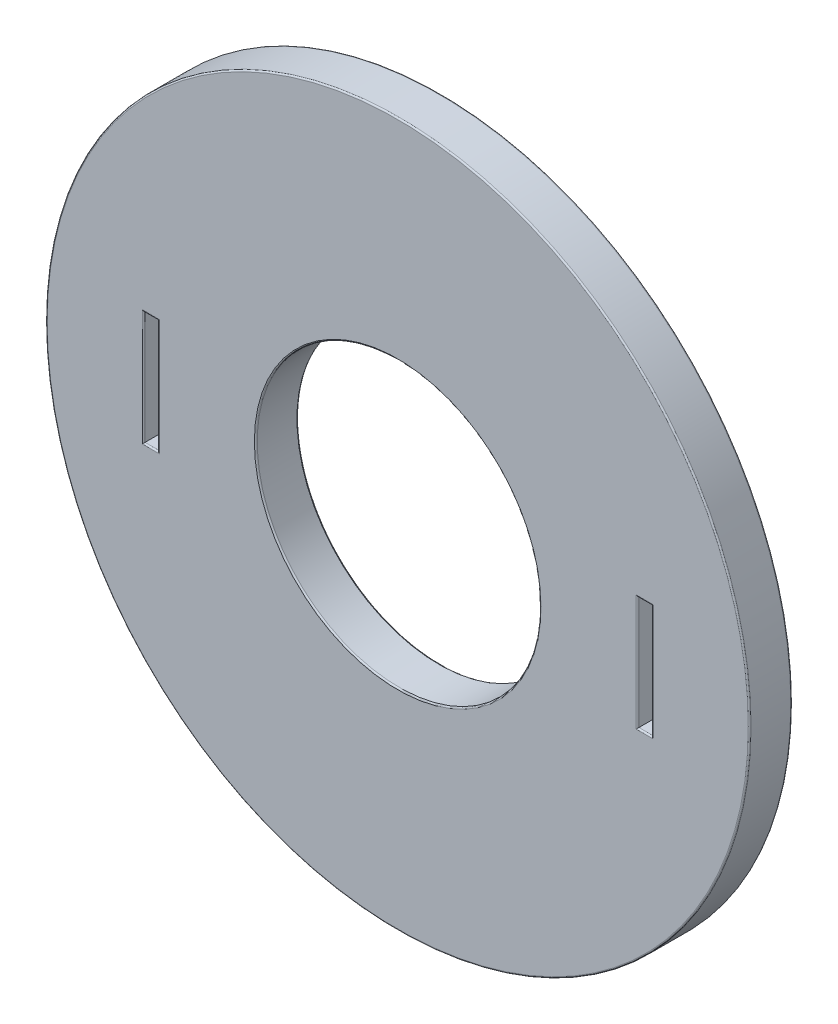
ISO-10303-21;
HEADER;
FILE_DESCRIPTION(('STEP AP214'),'2;1');
FILE_NAME('part.step','',(''),(''),'','','');
FILE_SCHEMA(('AUTOMOTIVE_DESIGN { 1 0 10303 214 1 1 1 1 }'));
ENDSEC;
DATA;
#1=APPLICATION_CONTEXT('core data for automotive mechanical design processes');
#2=APPLICATION_PROTOCOL_DEFINITION('international standard','automotive_design',2000,#1);
#3=PRODUCT_CONTEXT('',#1,'mechanical');
#4=PRODUCT('Part','Part','',(#3));
#5=PRODUCT_RELATED_PRODUCT_CATEGORY('part','',(#4));
#6=PRODUCT_DEFINITION_FORMATION('','',#4);
#7=PRODUCT_DEFINITION_CONTEXT('part definition',#1,'design');
#8=PRODUCT_DEFINITION('design','',#6,#7);
#9=PRODUCT_DEFINITION_SHAPE('','',#8);
#10=(LENGTH_UNIT() NAMED_UNIT(*) SI_UNIT(.MILLI.,.METRE.));
#11=(NAMED_UNIT(*) PLANE_ANGLE_UNIT() SI_UNIT($,.RADIAN.));
#12=(NAMED_UNIT(*) SI_UNIT($,.STERADIAN.) SOLID_ANGLE_UNIT());
#13=UNCERTAINTY_MEASURE_WITH_UNIT(LENGTH_MEASURE(1.E-05),#10,'distance_accuracy_value','');
#14=(GEOMETRIC_REPRESENTATION_CONTEXT(3) GLOBAL_UNCERTAINTY_ASSIGNED_CONTEXT((#13)) GLOBAL_UNIT_ASSIGNED_CONTEXT((#10,
#11,#12)) REPRESENTATION_CONTEXT('',''));
#15=CARTESIAN_POINT('',(0.,0.,0.));
#16=DIRECTION('',(0.,0.,1.));
#17=DIRECTION('',(1.,0.,0.));
#18=AXIS2_PLACEMENT_3D('',#15,#16,#17);
#19=CARTESIAN_POINT('',(0.,0.,1.5));
#20=DIRECTION('',(0.,0.,-1.));
#21=DIRECTION('',(-1.,0.,0.));
#22=AXIS2_PLACEMENT_3D('',#19,#20,#21);
#23=CYLINDRICAL_SURFACE('',#22,12.4);
#24=CARTESIAN_POINT('',(0.,0.,0.0499999999999999));
#25=DIRECTION('',(0.,0.,1.));
#26=DIRECTION('',(1.,0.,0.));
#27=AXIS2_PLACEMENT_3D('',#24,#25,#26);
#28=CIRCLE('',#27,12.4);
#29=CARTESIAN_POINT('',(12.4,0.,0.0499999999999999));
#30=VERTEX_POINT('',#29);
#31=EDGE_CURVE('E176',#30,#30,#28,.T.);
#32=ORIENTED_EDGE('',*,*,#31,.T.);
#33=EDGE_LOOP('',(#32));
#34=FACE_BOUND('',#33,.T.);
#35=CARTESIAN_POINT('',(0.,0.,1.45));
#36=DIRECTION('',(0.,0.,1.));
#37=DIRECTION('',(1.,0.,0.));
#38=AXIS2_PLACEMENT_3D('',#35,#36,#37);
#39=CIRCLE('',#38,12.4);
#40=CARTESIAN_POINT('',(12.4,0.,1.45));
#41=VERTEX_POINT('',#40);
#42=EDGE_CURVE('E425',#41,#41,#39,.F.);
#43=ORIENTED_EDGE('',*,*,#42,.T.);
#44=EDGE_LOOP('',(#43));
#45=FACE_BOUND('',#44,.T.);
#46=ADVANCED_FACE('F35',(#34,#45),#23,.T.);
#47=CARTESIAN_POINT('',(0.,0.,1.5));
#48=DIRECTION('',(0.,0.,1.));
#49=DIRECTION('',(1.,0.,0.));
#50=AXIS2_PLACEMENT_3D('',#47,#48,#49);
#51=PLANE('',#50);
#52=CARTESIAN_POINT('',(0.,0.,1.5));
#53=DIRECTION('',(0.,0.,1.));
#54=DIRECTION('',(1.,0.,0.));
#55=AXIS2_PLACEMENT_3D('',#52,#53,#54);
#56=CIRCLE('',#55,12.35);
#57=CARTESIAN_POINT('',(12.35,0.,1.5));
#58=VERTEX_POINT('',#57);
#59=EDGE_CURVE('E216',#58,#58,#56,.T.);
#60=ORIENTED_EDGE('',*,*,#59,.T.);
#61=EDGE_LOOP('',(#60));
#62=FACE_BOUND('',#61,.T.);
#63=CARTESIAN_POINT('',(0.,0.,1.5));
#64=DIRECTION('',(0.,0.,1.));
#65=DIRECTION('',(1.,0.,0.));
#66=AXIS2_PLACEMENT_3D('',#63,#64,#65);
#67=CIRCLE('',#66,5.05);
#68=CARTESIAN_POINT('',(5.05,0.,1.5));
#69=VERTEX_POINT('',#68);
#70=EDGE_CURVE('E213',#69,#69,#67,.F.);
#71=ORIENTED_EDGE('',*,*,#70,.T.);
#72=EDGE_LOOP('',(#71));
#73=FACE_BOUND('',#72,.T.);
#74=DIRECTION('',(0.,1.,0.));
#75=VECTOR('',#74,1.);
#76=CARTESIAN_POINT('',(-8.4,-2.,1.5));
#77=LINE('',#76,#75);
#78=CARTESIAN_POINT('',(-8.4,2.05,1.5));
#79=VERTEX_POINT('',#78);
#80=CARTESIAN_POINT('',(-8.4,-2.05,1.5));
#81=VERTEX_POINT('',#80);
#82=EDGE_CURVE('E208',#79,#81,#77,.F.);
#83=ORIENTED_EDGE('',*,*,#82,.T.);
#84=DIRECTION('',(1.,0.,0.));
#85=VECTOR('',#84,1.);
#86=CARTESIAN_POINT('',(-8.95,-2.05,1.5));
#87=LINE('',#86,#85);
#88=CARTESIAN_POINT('',(-9.,-2.05,1.5));
#89=VERTEX_POINT('',#88);
#90=EDGE_CURVE('E210',#81,#89,#87,.F.);
#91=ORIENTED_EDGE('',*,*,#90,.T.);
#92=DIRECTION('',(0.,-1.,0.));
#93=VECTOR('',#92,1.);
#94=CARTESIAN_POINT('',(-9.,2.,1.5));
#95=LINE('',#94,#93);
#96=CARTESIAN_POINT('',(-9.,2.05,1.5));
#97=VERTEX_POINT('',#96);
#98=EDGE_CURVE('E204',#89,#97,#95,.F.);
#99=ORIENTED_EDGE('',*,*,#98,.T.);
#100=DIRECTION('',(-1.,0.,0.));
#101=VECTOR('',#100,1.);
#102=CARTESIAN_POINT('',(-8.45,2.05,1.5));
#103=LINE('',#102,#101);
#104=EDGE_CURVE('E206',#97,#79,#103,.F.);
#105=ORIENTED_EDGE('',*,*,#104,.T.);
#106=EDGE_LOOP('',(#83,#91,#99,#105));
#107=FACE_BOUND('',#106,.T.);
#108=DIRECTION('',(0.,1.,0.));
#109=VECTOR('',#108,1.);
#110=CARTESIAN_POINT('',(9.,-2.,1.5));
#111=LINE('',#110,#109);
#112=CARTESIAN_POINT('',(9.,2.05,1.5));
#113=VERTEX_POINT('',#112);
#114=CARTESIAN_POINT('',(9.,-2.05,1.5));
#115=VERTEX_POINT('',#114);
#116=EDGE_CURVE('E199',#113,#115,#111,.F.);
#117=ORIENTED_EDGE('',*,*,#116,.T.);
#118=DIRECTION('',(1.,0.,0.));
#119=VECTOR('',#118,1.);
#120=CARTESIAN_POINT('',(8.45,-2.05,1.5));
#121=LINE('',#120,#119);
#122=CARTESIAN_POINT('',(8.4,-2.05,1.5));
#123=VERTEX_POINT('',#122);
#124=EDGE_CURVE('E201',#115,#123,#121,.F.);
#125=ORIENTED_EDGE('',*,*,#124,.T.);
#126=DIRECTION('',(0.,-1.,0.));
#127=VECTOR('',#126,1.);
#128=CARTESIAN_POINT('',(8.4,2.,1.5));
#129=LINE('',#128,#127);
#130=CARTESIAN_POINT('',(8.4,2.05,1.5));
#131=VERTEX_POINT('',#130);
#132=EDGE_CURVE('E195',#123,#131,#129,.F.);
#133=ORIENTED_EDGE('',*,*,#132,.T.);
#134=DIRECTION('',(-1.,0.,0.));
#135=VECTOR('',#134,1.);
#136=CARTESIAN_POINT('',(8.95,2.05,1.5));
#137=LINE('',#136,#135);
#138=EDGE_CURVE('E197',#131,#113,#137,.F.);
#139=ORIENTED_EDGE('',*,*,#138,.T.);
#140=EDGE_LOOP('',(#117,#125,#133,#139));
#141=FACE_BOUND('',#140,.T.);
#142=ADVANCED_FACE('F317',(#62,#73,#107,#141),#51,.T.);
#143=CARTESIAN_POINT('',(0.,0.,0.));
#144=DIRECTION('',(0.,0.,1.));
#145=DIRECTION('',(1.,0.,0.));
#146=AXIS2_PLACEMENT_3D('',#143,#144,#145);
#147=PLANE('',#146);
#148=CARTESIAN_POINT('',(0.,0.,0.));
#149=DIRECTION('',(0.,0.,1.));
#150=DIRECTION('',(1.,0.,0.));
#151=AXIS2_PLACEMENT_3D('',#148,#149,#150);
#152=CIRCLE('',#151,12.35);
#153=CARTESIAN_POINT('',(12.35,0.,0.));
#154=VERTEX_POINT('',#153);
#155=EDGE_CURVE('E192',#154,#154,#152,.F.);
#156=ORIENTED_EDGE('',*,*,#155,.T.);
#157=EDGE_LOOP('',(#156));
#158=FACE_BOUND('',#157,.T.);
#159=DIRECTION('',(0.,-1.,0.));
#160=VECTOR('',#159,1.);
#161=CARTESIAN_POINT('',(-9.,0.,0.));
#162=LINE('',#161,#160);
#163=CARTESIAN_POINT('',(-9.,2.05,0.));
#164=VERTEX_POINT('',#163);
#165=CARTESIAN_POINT('',(-9.,-2.05,0.));
#166=VERTEX_POINT('',#165);
#167=EDGE_CURVE('E187',#164,#166,#162,.T.);
#168=ORIENTED_EDGE('',*,*,#167,.T.);
#169=DIRECTION('',(1.,0.,0.));
#170=VECTOR('',#169,1.);
#171=CARTESIAN_POINT('',(0.,-2.05,0.));
#172=LINE('',#171,#170);
#173=CARTESIAN_POINT('',(-8.4,-2.05,0.));
#174=VERTEX_POINT('',#173);
#175=EDGE_CURVE('E189',#166,#174,#172,.T.);
#176=ORIENTED_EDGE('',*,*,#175,.T.);
#177=DIRECTION('',(0.,1.,0.));
#178=VECTOR('',#177,1.);
#179=CARTESIAN_POINT('',(-8.4,0.,0.));
#180=LINE('',#179,#178);
#181=CARTESIAN_POINT('',(-8.4,2.05,0.));
#182=VERTEX_POINT('',#181);
#183=EDGE_CURVE('E185',#174,#182,#180,.T.);
#184=ORIENTED_EDGE('',*,*,#183,.T.);
#185=DIRECTION('',(-1.,0.,0.));
#186=VECTOR('',#185,1.);
#187=CARTESIAN_POINT('',(0.,2.04999999999999,0.));
#188=LINE('',#187,#186);
#189=EDGE_CURVE('E183',#182,#164,#188,.T.);
#190=ORIENTED_EDGE('',*,*,#189,.T.);
#191=EDGE_LOOP('',(#168,#176,#184,#190));
#192=FACE_BOUND('',#191,.T.);
#193=DIRECTION('',(0.,-1.,0.));
#194=VECTOR('',#193,1.);
#195=CARTESIAN_POINT('',(8.4,0.,0.));
#196=LINE('',#195,#194);
#197=CARTESIAN_POINT('',(8.4,2.05,0.));
#198=VERTEX_POINT('',#197);
#199=CARTESIAN_POINT('',(8.4,-2.05,0.));
#200=VERTEX_POINT('',#199);
#201=EDGE_CURVE('E155',#198,#200,#196,.T.);
#202=ORIENTED_EDGE('',*,*,#201,.T.);
#203=DIRECTION('',(1.,0.,0.));
#204=VECTOR('',#203,1.);
#205=CARTESIAN_POINT('',(0.,-2.05,0.));
#206=LINE('',#205,#204);
#207=CARTESIAN_POINT('',(9.,-2.05,0.));
#208=VERTEX_POINT('',#207);
#209=EDGE_CURVE('E181',#200,#208,#206,.T.);
#210=ORIENTED_EDGE('',*,*,#209,.T.);
#211=DIRECTION('',(0.,1.,0.));
#212=VECTOR('',#211,1.);
#213=CARTESIAN_POINT('',(9.,0.,0.));
#214=LINE('',#213,#212);
#215=CARTESIAN_POINT('',(9.,2.05,0.));
#216=VERTEX_POINT('',#215);
#217=EDGE_CURVE('E158',#208,#216,#214,.T.);
#218=ORIENTED_EDGE('',*,*,#217,.T.);
#219=DIRECTION('',(-1.,0.,0.));
#220=VECTOR('',#219,1.);
#221=CARTESIAN_POINT('',(0.,2.05000000000001,0.));
#222=LINE('',#221,#220);
#223=EDGE_CURVE('E149',#216,#198,#222,.T.);
#224=ORIENTED_EDGE('',*,*,#223,.T.);
#225=EDGE_LOOP('',(#202,#210,#218,#224));
#226=FACE_BOUND('',#225,.T.);
#227=CARTESIAN_POINT('',(0.,0.,0.));
#228=DIRECTION('',(0.,0.,1.));
#229=DIRECTION('',(1.,0.,0.));
#230=AXIS2_PLACEMENT_3D('',#227,#228,#229);
#231=CIRCLE('',#230,5.05);
#232=CARTESIAN_POINT('',(5.05,0.,0.));
#233=VERTEX_POINT('',#232);
#234=EDGE_CURVE('E173',#233,#233,#231,.T.);
#235=ORIENTED_EDGE('',*,*,#234,.T.);
#236=EDGE_LOOP('',(#235));
#237=FACE_BOUND('',#236,.T.);
#238=ADVANCED_FACE('F151',(#158,#192,#226,#237),#147,.F.);
#239=CARTESIAN_POINT('',(0.,0.,0.));
#240=DIRECTION('',(0.,0.,1.));
#241=DIRECTION('',(1.,0.,0.));
#242=AXIS2_PLACEMENT_3D('',#239,#240,#241);
#243=CYLINDRICAL_SURFACE('',#242,5.);
#244=CARTESIAN_POINT('',(0.,0.,1.45));
#245=DIRECTION('',(0.,0.,1.));
#246=DIRECTION('',(1.,0.,0.));
#247=AXIS2_PLACEMENT_3D('',#244,#245,#246);
#248=CIRCLE('',#247,5.);
#249=CARTESIAN_POINT('',(5.,0.,1.45));
#250=VERTEX_POINT('',#249);
#251=EDGE_CURVE('E222',#250,#250,#248,.T.);
#252=ORIENTED_EDGE('',*,*,#251,.T.);
#253=EDGE_LOOP('',(#252));
#254=FACE_BOUND('',#253,.T.);
#255=CARTESIAN_POINT('',(0.,0.,0.05));
#256=DIRECTION('',(0.,0.,1.));
#257=DIRECTION('',(1.,0.,0.));
#258=AXIS2_PLACEMENT_3D('',#255,#256,#257);
#259=CIRCLE('',#258,5.);
#260=CARTESIAN_POINT('',(5.,0.,0.05));
#261=VERTEX_POINT('',#260);
#262=EDGE_CURVE('E219',#261,#261,#259,.F.);
#263=ORIENTED_EDGE('',*,*,#262,.T.);
#264=EDGE_LOOP('',(#263));
#265=FACE_BOUND('',#264,.T.);
#266=ADVANCED_FACE('F468',(#254,#265),#243,.F.);
#267=CARTESIAN_POINT('',(-8.95,2.,0.));
#268=DIRECTION('',(-1.,0.,0.));
#269=DIRECTION('',(0.,0.,1.));
#270=AXIS2_PLACEMENT_3D('',#267,#268,#269);
#271=PLANE('',#270);
#272=DIRECTION('',(0.,0.,1.));
#273=VECTOR('',#272,1.);
#274=CARTESIAN_POINT('',(-8.95,2.,0.));
#275=LINE('',#274,#273);
#276=CARTESIAN_POINT('',(-8.95,2.,0.05));
#277=VERTEX_POINT('',#276);
#278=CARTESIAN_POINT('',(-8.95,2.,1.45));
#279=VERTEX_POINT('',#278);
#280=EDGE_CURVE('E420',#277,#279,#275,.T.);
#281=ORIENTED_EDGE('',*,*,#280,.T.);
#282=DIRECTION('',(0.,-1.,0.));
#283=VECTOR('',#282,1.);
#284=CARTESIAN_POINT('',(-8.95,-2.,1.45));
#285=LINE('',#284,#283);
#286=CARTESIAN_POINT('',(-8.95,-2.,1.45));
#287=VERTEX_POINT('',#286);
#288=EDGE_CURVE('E241',#279,#287,#285,.T.);
#289=ORIENTED_EDGE('',*,*,#288,.T.);
#290=DIRECTION('',(0.,0.,1.));
#291=VECTOR('',#290,1.);
#292=CARTESIAN_POINT('',(-8.95,-2.,0.));
#293=LINE('',#292,#291);
#294=CARTESIAN_POINT('',(-8.95,-2.,0.05));
#295=VERTEX_POINT('',#294);
#296=EDGE_CURVE('E410',#295,#287,#293,.T.);
#297=ORIENTED_EDGE('',*,*,#296,.F.);
#298=DIRECTION('',(0.,-1.,0.));
#299=VECTOR('',#298,1.);
#300=CARTESIAN_POINT('',(-8.95,2.,0.05));
#301=LINE('',#300,#299);
#302=EDGE_CURVE('E239',#295,#277,#301,.F.);
#303=ORIENTED_EDGE('',*,*,#302,.T.);
#304=EDGE_LOOP('',(#281,#289,#297,#303));
#305=FACE_BOUND('',#304,.T.);
#306=ADVANCED_FACE('F419',(#305),#271,.F.);
#307=CARTESIAN_POINT('',(-8.95,2.,0.));
#308=DIRECTION('',(0.,1.,0.));
#309=DIRECTION('',(-1.,0.,0.));
#310=AXIS2_PLACEMENT_3D('',#307,#308,#309);
#311=PLANE('',#310);
#312=DIRECTION('',(0.,0.,1.));
#313=VECTOR('',#312,1.);
#314=CARTESIAN_POINT('',(-8.45,2.,0.));
#315=LINE('',#314,#313);
#316=CARTESIAN_POINT('',(-8.45,2.,0.05));
#317=VERTEX_POINT('',#316);
#318=CARTESIAN_POINT('',(-8.45,2.,1.45));
#319=VERTEX_POINT('',#318);
#320=EDGE_CURVE('E403',#317,#319,#315,.T.);
#321=ORIENTED_EDGE('',*,*,#320,.T.);
#322=DIRECTION('',(-1.,0.,0.));
#323=VECTOR('',#322,1.);
#324=CARTESIAN_POINT('',(-8.95,2.,1.45));
#325=LINE('',#324,#323);
#326=EDGE_CURVE('E237',#319,#279,#325,.T.);
#327=ORIENTED_EDGE('',*,*,#326,.T.);
#328=ORIENTED_EDGE('',*,*,#280,.F.);
#329=DIRECTION('',(-1.,0.,0.));
#330=VECTOR('',#329,1.);
#331=CARTESIAN_POINT('',(-8.95,2.,0.05));
#332=LINE('',#331,#330);
#333=EDGE_CURVE('E235',#277,#317,#332,.F.);
#334=ORIENTED_EDGE('',*,*,#333,.T.);
#335=EDGE_LOOP('',(#321,#327,#328,#334));
#336=FACE_BOUND('',#335,.T.);
#337=ADVANCED_FACE('F423',(#336),#311,.F.);
#338=CARTESIAN_POINT('',(-8.45,2.,0.));
#339=DIRECTION('',(1.,0.,0.));
#340=DIRECTION('',(0.,0.,-1.));
#341=AXIS2_PLACEMENT_3D('',#338,#339,#340);
#342=PLANE('',#341);
#343=DIRECTION('',(0.,0.,1.));
#344=VECTOR('',#343,1.);
#345=CARTESIAN_POINT('',(-8.45,-2.,0.));
#346=LINE('',#345,#344);
#347=CARTESIAN_POINT('',(-8.45,-2.,0.05));
#348=VERTEX_POINT('',#347);
#349=CARTESIAN_POINT('',(-8.45,-2.,1.45));
#350=VERTEX_POINT('',#349);
#351=EDGE_CURVE('E401',#348,#350,#346,.T.);
#352=ORIENTED_EDGE('',*,*,#351,.T.);
#353=DIRECTION('',(0.,1.,0.));
#354=VECTOR('',#353,1.);
#355=CARTESIAN_POINT('',(-8.45,2.,1.45));
#356=LINE('',#355,#354);
#357=EDGE_CURVE('E233',#350,#319,#356,.T.);
#358=ORIENTED_EDGE('',*,*,#357,.T.);
#359=ORIENTED_EDGE('',*,*,#320,.F.);
#360=DIRECTION('',(0.,1.,0.));
#361=VECTOR('',#360,1.);
#362=CARTESIAN_POINT('',(-8.45,2.,0.05));
#363=LINE('',#362,#361);
#364=EDGE_CURVE('E231',#317,#348,#363,.F.);
#365=ORIENTED_EDGE('',*,*,#364,.T.);
#366=EDGE_LOOP('',(#352,#358,#359,#365));
#367=FACE_BOUND('',#366,.T.);
#368=ADVANCED_FACE('F400',(#367),#342,.F.);
#369=CARTESIAN_POINT('',(-8.95,-2.,0.));
#370=DIRECTION('',(0.,-1.,0.));
#371=DIRECTION('',(0.,0.,-1.));
#372=AXIS2_PLACEMENT_3D('',#369,#370,#371);
#373=PLANE('',#372);
#374=ORIENTED_EDGE('',*,*,#296,.T.);
#375=DIRECTION('',(1.,0.,0.));
#376=VECTOR('',#375,1.);
#377=CARTESIAN_POINT('',(-8.45,-2.,1.45));
#378=LINE('',#377,#376);
#379=EDGE_CURVE('E228',#287,#350,#378,.T.);
#380=ORIENTED_EDGE('',*,*,#379,.T.);
#381=ORIENTED_EDGE('',*,*,#351,.F.);
#382=DIRECTION('',(1.,0.,0.));
#383=VECTOR('',#382,1.);
#384=CARTESIAN_POINT('',(-8.95,-2.,0.05));
#385=LINE('',#384,#383);
#386=EDGE_CURVE('E225',#348,#295,#385,.F.);
#387=ORIENTED_EDGE('',*,*,#386,.T.);
#388=EDGE_LOOP('',(#374,#380,#381,#387));
#389=FACE_BOUND('',#388,.T.);
#390=ADVANCED_FACE('F407',(#389),#373,.F.);
#391=CARTESIAN_POINT('',(8.45,2.,0.));
#392=DIRECTION('',(-1.,0.,0.));
#393=DIRECTION('',(0.,0.,1.));
#394=AXIS2_PLACEMENT_3D('',#391,#392,#393);
#395=PLANE('',#394);
#396=DIRECTION('',(0.,0.,1.));
#397=VECTOR('',#396,1.);
#398=CARTESIAN_POINT('',(8.45,2.,0.));
#399=LINE('',#398,#397);
#400=CARTESIAN_POINT('',(8.45,2.,0.05));
#401=VERTEX_POINT('',#400);
#402=CARTESIAN_POINT('',(8.45,2.,1.45));
#403=VERTEX_POINT('',#402);
#404=EDGE_CURVE('E432',#401,#403,#399,.T.);
#405=ORIENTED_EDGE('',*,*,#404,.T.);
#406=DIRECTION('',(0.,-1.,0.));
#407=VECTOR('',#406,1.);
#408=CARTESIAN_POINT('',(8.45,-2.,1.45));
#409=LINE('',#408,#407);
#410=CARTESIAN_POINT('',(8.45,-2.,1.45));
#411=VERTEX_POINT('',#410);
#412=EDGE_CURVE('E11',#403,#411,#409,.T.);
#413=ORIENTED_EDGE('',*,*,#412,.T.);
#414=DIRECTION('',(0.,0.,1.));
#415=VECTOR('',#414,1.);
#416=CARTESIAN_POINT('',(8.45,-2.,0.));
#417=LINE('',#416,#415);
#418=CARTESIAN_POINT('',(8.45,-2.,0.05));
#419=VERTEX_POINT('',#418);
#420=EDGE_CURVE('E267',#419,#411,#417,.T.);
#421=ORIENTED_EDGE('',*,*,#420,.F.);
#422=DIRECTION('',(0.,-1.,0.));
#423=VECTOR('',#422,1.);
#424=CARTESIAN_POINT('',(8.45,2.,0.05));
#425=LINE('',#424,#423);
#426=EDGE_CURVE('E44',#419,#401,#425,.F.);
#427=ORIENTED_EDGE('',*,*,#426,.T.);
#428=EDGE_LOOP('',(#405,#413,#421,#427));
#429=FACE_BOUND('',#428,.T.);
#430=ADVANCED_FACE('F450',(#429),#395,.F.);
#431=CARTESIAN_POINT('',(8.45,2.,0.));
#432=DIRECTION('',(0.,1.,0.));
#433=DIRECTION('',(-1.,0.,0.));
#434=AXIS2_PLACEMENT_3D('',#431,#432,#433);
#435=PLANE('',#434);
#436=DIRECTION('',(0.,0.,1.));
#437=VECTOR('',#436,1.);
#438=CARTESIAN_POINT('',(8.95,2.,0.));
#439=LINE('',#438,#437);
#440=CARTESIAN_POINT('',(8.95,2.,0.05));
#441=VERTEX_POINT('',#440);
#442=CARTESIAN_POINT('',(8.95,2.,1.45));
#443=VERTEX_POINT('',#442);
#444=EDGE_CURVE('E298',#441,#443,#439,.T.);
#445=ORIENTED_EDGE('',*,*,#444,.T.);
#446=DIRECTION('',(-1.,0.,0.));
#447=VECTOR('',#446,1.);
#448=CARTESIAN_POINT('',(8.45,2.,1.45));
#449=LINE('',#448,#447);
#450=EDGE_CURVE('E52',#443,#403,#449,.T.);
#451=ORIENTED_EDGE('',*,*,#450,.T.);
#452=ORIENTED_EDGE('',*,*,#404,.F.);
#453=DIRECTION('',(-1.,0.,0.));
#454=VECTOR('',#453,1.);
#455=CARTESIAN_POINT('',(8.45,2.,0.05));
#456=LINE('',#455,#454);
#457=EDGE_CURVE('E166',#401,#441,#456,.F.);
#458=ORIENTED_EDGE('',*,*,#457,.T.);
#459=EDGE_LOOP('',(#445,#451,#452,#458));
#460=FACE_BOUND('',#459,.T.);
#461=ADVANCED_FACE('F439',(#460),#435,.F.);
#462=CARTESIAN_POINT('',(8.95,2.,0.));
#463=DIRECTION('',(1.,0.,0.));
#464=DIRECTION('',(0.,0.,-1.));
#465=AXIS2_PLACEMENT_3D('',#462,#463,#464);
#466=PLANE('',#465);
#467=DIRECTION('',(0.,0.,1.));
#468=VECTOR('',#467,1.);
#469=CARTESIAN_POINT('',(8.95,-2.,0.));
#470=LINE('',#469,#468);
#471=CARTESIAN_POINT('',(8.95,-2.,0.05));
#472=VERTEX_POINT('',#471);
#473=CARTESIAN_POINT('',(8.95,-2.,1.45));
#474=VERTEX_POINT('',#473);
#475=EDGE_CURVE('E297',#472,#474,#470,.T.);
#476=ORIENTED_EDGE('',*,*,#475,.T.);
#477=DIRECTION('',(0.,1.,0.));
#478=VECTOR('',#477,1.);
#479=CARTESIAN_POINT('',(8.95,2.,1.45));
#480=LINE('',#479,#478);
#481=EDGE_CURVE('E251',#474,#443,#480,.T.);
#482=ORIENTED_EDGE('',*,*,#481,.T.);
#483=ORIENTED_EDGE('',*,*,#444,.F.);
#484=DIRECTION('',(0.,1.,0.));
#485=VECTOR('',#484,1.);
#486=CARTESIAN_POINT('',(8.95,2.,0.05));
#487=LINE('',#486,#485);
#488=EDGE_CURVE('E249',#441,#472,#487,.F.);
#489=ORIENTED_EDGE('',*,*,#488,.T.);
#490=EDGE_LOOP('',(#476,#482,#483,#489));
#491=FACE_BOUND('',#490,.T.);
#492=ADVANCED_FACE('F296',(#491),#466,.F.);
#493=CARTESIAN_POINT('',(8.45,-2.,0.));
#494=DIRECTION('',(0.,-1.,0.));
#495=DIRECTION('',(0.,0.,-1.));
#496=AXIS2_PLACEMENT_3D('',#493,#494,#495);
#497=PLANE('',#496);
#498=ORIENTED_EDGE('',*,*,#420,.T.);
#499=DIRECTION('',(1.,0.,0.));
#500=VECTOR('',#499,1.);
#501=CARTESIAN_POINT('',(8.95,-2.,1.45));
#502=LINE('',#501,#500);
#503=EDGE_CURVE('E246',#411,#474,#502,.T.);
#504=ORIENTED_EDGE('',*,*,#503,.T.);
#505=ORIENTED_EDGE('',*,*,#475,.F.);
#506=DIRECTION('',(1.,0.,0.));
#507=VECTOR('',#506,1.);
#508=CARTESIAN_POINT('',(8.45,-2.,0.05));
#509=LINE('',#508,#507);
#510=EDGE_CURVE('E243',#472,#419,#509,.F.);
#511=ORIENTED_EDGE('',*,*,#510,.T.);
#512=EDGE_LOOP('',(#498,#504,#505,#511));
#513=FACE_BOUND('',#512,.T.);
#514=ADVANCED_FACE('F302',(#513),#497,.F.);
#515=CARTESIAN_POINT('',(0.,0.,0.0499999999999999));
#516=DIRECTION('',(0.,0.,1.));
#517=DIRECTION('',(1.,0.,0.));
#518=AXIS2_PLACEMENT_3D('',#515,#516,#517);
#519=TOROIDAL_SURFACE('',#518,12.35,0.05);
#520=ORIENTED_EDGE('',*,*,#155,.F.);
#521=EDGE_LOOP('',(#520));
#522=FACE_BOUND('',#521,.T.);
#523=ORIENTED_EDGE('',*,*,#31,.F.);
#524=EDGE_LOOP('',(#523));
#525=FACE_BOUND('',#524,.T.);
#526=ADVANCED_FACE('F329',(#522,#525),#519,.T.);
#527=CARTESIAN_POINT('',(0.,0.,1.45));
#528=DIRECTION('',(0.,0.,1.));
#529=DIRECTION('',(1.,0.,0.));
#530=AXIS2_PLACEMENT_3D('',#527,#528,#529);
#531=TOROIDAL_SURFACE('',#530,12.35,0.05);
#532=ORIENTED_EDGE('',*,*,#42,.F.);
#533=EDGE_LOOP('',(#532));
#534=FACE_BOUND('',#533,.T.);
#535=ORIENTED_EDGE('',*,*,#59,.F.);
#536=EDGE_LOOP('',(#535));
#537=FACE_BOUND('',#536,.T.);
#538=ADVANCED_FACE('F332',(#534,#537),#531,.T.);
#539=CARTESIAN_POINT('',(0.,0.,1.45));
#540=DIRECTION('',(0.,0.,1.));
#541=DIRECTION('',(1.,0.,0.));
#542=AXIS2_PLACEMENT_3D('',#539,#540,#541);
#543=TOROIDAL_SURFACE('',#542,5.05,0.05);
#544=ORIENTED_EDGE('',*,*,#70,.F.);
#545=EDGE_LOOP('',(#544));
#546=FACE_BOUND('',#545,.T.);
#547=ORIENTED_EDGE('',*,*,#251,.F.);
#548=EDGE_LOOP('',(#547));
#549=FACE_BOUND('',#548,.T.);
#550=ADVANCED_FACE('F336',(#546,#549),#543,.T.);
#551=CARTESIAN_POINT('',(-8.95,2.05,1.45));
#552=DIRECTION('',(1.,0.,0.));
#553=DIRECTION('',(0.,1.,0.));
#554=AXIS2_PLACEMENT_3D('',#551,#552,#553);
#555=CYLINDRICAL_SURFACE('',#554,0.05);
#556=CARTESIAN_POINT('',(-8.4,2.05,1.45));
#557=DIRECTION('',(0.707106781186547,-0.707106781186548,0.));
#558=DIRECTION('',(-0.707106781186548,-0.707106781186547,0.));
#559=AXIS2_PLACEMENT_3D('',#556,#557,#558);
#560=ELLIPSE('',#559,0.0707106781186547,0.05);
#561=EDGE_CURVE('E261',#79,#319,#560,.T.);
#562=ORIENTED_EDGE('',*,*,#561,.F.);
#563=ORIENTED_EDGE('',*,*,#104,.F.);
#564=CARTESIAN_POINT('',(-9.,2.05,1.45));
#565=DIRECTION('',(0.707106781186548,0.707106781186547,0.));
#566=DIRECTION('',(0.707106781186547,-0.707106781186548,0.));
#567=AXIS2_PLACEMENT_3D('',#564,#565,#566);
#568=ELLIPSE('',#567,0.0707106781186548,0.05);
#569=EDGE_CURVE('E264',#279,#97,#568,.F.);
#570=ORIENTED_EDGE('',*,*,#569,.F.);
#571=ORIENTED_EDGE('',*,*,#326,.F.);
#572=EDGE_LOOP('',(#562,#563,#570,#571));
#573=FACE_BOUND('',#572,.T.);
#574=ADVANCED_FACE('F340',(#573),#555,.T.);
#575=CARTESIAN_POINT('',(-9.,2.,1.45));
#576=DIRECTION('',(0.,1.,0.));
#577=DIRECTION('',(0.,0.,1.));
#578=AXIS2_PLACEMENT_3D('',#575,#576,#577);
#579=CYLINDRICAL_SURFACE('',#578,0.05);
#580=ORIENTED_EDGE('',*,*,#569,.T.);
#581=ORIENTED_EDGE('',*,*,#98,.F.);
#582=CARTESIAN_POINT('',(-9.,-2.05,1.45));
#583=DIRECTION('',(-0.707106781186547,0.707106781186547,0.));
#584=DIRECTION('',(-0.707106781186547,-0.707106781186547,0.));
#585=AXIS2_PLACEMENT_3D('',#582,#583,#584);
#586=ELLIPSE('',#585,0.0707106781186548,0.05);
#587=EDGE_CURVE('E258',#287,#89,#586,.F.);
#588=ORIENTED_EDGE('',*,*,#587,.F.);
#589=ORIENTED_EDGE('',*,*,#288,.F.);
#590=EDGE_LOOP('',(#580,#581,#588,#589));
#591=FACE_BOUND('',#590,.T.);
#592=ADVANCED_FACE('F350',(#591),#579,.T.);
#593=CARTESIAN_POINT('',(-8.4,2.,1.45));
#594=DIRECTION('',(0.,-1.,0.));
#595=DIRECTION('',(0.,0.,-1.));
#596=AXIS2_PLACEMENT_3D('',#593,#594,#595);
#597=CYLINDRICAL_SURFACE('',#596,0.05);
#598=ORIENTED_EDGE('',*,*,#561,.T.);
#599=ORIENTED_EDGE('',*,*,#357,.F.);
#600=CARTESIAN_POINT('',(-8.4,-2.05,1.45));
#601=DIRECTION('',(-0.707106781186547,-0.707106781186547,0.));
#602=DIRECTION('',(-0.707106781186547,0.707106781186547,0.));
#603=AXIS2_PLACEMENT_3D('',#600,#601,#602);
#604=ELLIPSE('',#603,0.0707106781186548,0.05);
#605=EDGE_CURVE('E256',#81,#350,#604,.T.);
#606=ORIENTED_EDGE('',*,*,#605,.F.);
#607=ORIENTED_EDGE('',*,*,#82,.F.);
#608=EDGE_LOOP('',(#598,#599,#606,#607));
#609=FACE_BOUND('',#608,.T.);
#610=ADVANCED_FACE('F346',(#609),#597,.T.);
#611=CARTESIAN_POINT('',(-8.95,-2.05,1.45));
#612=DIRECTION('',(-1.,0.,0.));
#613=DIRECTION('',(0.,0.,1.));
#614=AXIS2_PLACEMENT_3D('',#611,#612,#613);
#615=CYLINDRICAL_SURFACE('',#614,0.05);
#616=ORIENTED_EDGE('',*,*,#587,.T.);
#617=ORIENTED_EDGE('',*,*,#90,.F.);
#618=ORIENTED_EDGE('',*,*,#605,.T.);
#619=ORIENTED_EDGE('',*,*,#379,.F.);
#620=EDGE_LOOP('',(#616,#617,#618,#619));
#621=FACE_BOUND('',#620,.T.);
#622=ADVANCED_FACE('F342',(#621),#615,.T.);
#623=CARTESIAN_POINT('',(8.45,2.05,1.45));
#624=DIRECTION('',(1.,0.,0.));
#625=DIRECTION('',(0.,1.,0.));
#626=AXIS2_PLACEMENT_3D('',#623,#624,#625);
#627=CYLINDRICAL_SURFACE('',#626,0.05);
#628=CARTESIAN_POINT('',(9.,2.05,1.45));
#629=DIRECTION('',(0.707106781186547,-0.707106781186548,0.));
#630=DIRECTION('',(-0.707106781186548,-0.707106781186547,0.));
#631=AXIS2_PLACEMENT_3D('',#628,#629,#630);
#632=ELLIPSE('',#631,0.0707106781186547,0.05);
#633=EDGE_CURVE('E273',#113,#443,#632,.T.);
#634=ORIENTED_EDGE('',*,*,#633,.F.);
#635=ORIENTED_EDGE('',*,*,#138,.F.);
#636=CARTESIAN_POINT('',(8.4,2.05,1.45));
#637=DIRECTION('',(0.707106781186548,0.707106781186547,0.));
#638=DIRECTION('',(0.707106781186547,-0.707106781186548,0.));
#639=AXIS2_PLACEMENT_3D('',#636,#637,#638);
#640=ELLIPSE('',#639,0.0707106781186548,0.05);
#641=EDGE_CURVE('E259',#403,#131,#640,.F.);
#642=ORIENTED_EDGE('',*,*,#641,.F.);
#643=ORIENTED_EDGE('',*,*,#450,.F.);
#644=EDGE_LOOP('',(#634,#635,#642,#643));
#645=FACE_BOUND('',#644,.T.);
#646=ADVANCED_FACE('F345',(#645),#627,.T.);
#647=CARTESIAN_POINT('',(8.4,2.,1.45));
#648=DIRECTION('',(0.,1.,0.));
#649=DIRECTION('',(0.,0.,1.));
#650=AXIS2_PLACEMENT_3D('',#647,#648,#649);
#651=CYLINDRICAL_SURFACE('',#650,0.05);
#652=ORIENTED_EDGE('',*,*,#641,.T.);
#653=ORIENTED_EDGE('',*,*,#132,.F.);
#654=CARTESIAN_POINT('',(8.4,-2.05,1.45));
#655=DIRECTION('',(-0.707106781186547,0.707106781186547,0.));
#656=DIRECTION('',(-0.707106781186547,-0.707106781186547,0.));
#657=AXIS2_PLACEMENT_3D('',#654,#655,#656);
#658=ELLIPSE('',#657,0.0707106781186548,0.05);
#659=EDGE_CURVE('E270',#411,#123,#658,.F.);
#660=ORIENTED_EDGE('',*,*,#659,.F.);
#661=ORIENTED_EDGE('',*,*,#412,.F.);
#662=EDGE_LOOP('',(#652,#653,#660,#661));
#663=FACE_BOUND('',#662,.T.);
#664=ADVANCED_FACE('F366',(#663),#651,.T.);
#665=CARTESIAN_POINT('',(9.,2.,1.45));
#666=DIRECTION('',(0.,-1.,0.));
#667=DIRECTION('',(0.,0.,-1.));
#668=AXIS2_PLACEMENT_3D('',#665,#666,#667);
#669=CYLINDRICAL_SURFACE('',#668,0.05);
#670=ORIENTED_EDGE('',*,*,#633,.T.);
#671=ORIENTED_EDGE('',*,*,#481,.F.);
#672=CARTESIAN_POINT('',(9.,-2.05,1.45));
#673=DIRECTION('',(-0.707106781186547,-0.707106781186547,0.));
#674=DIRECTION('',(-0.707106781186547,0.707106781186547,0.));
#675=AXIS2_PLACEMENT_3D('',#672,#673,#674);
#676=ELLIPSE('',#675,0.0707106781186548,0.05);
#677=EDGE_CURVE('E268',#115,#474,#676,.T.);
#678=ORIENTED_EDGE('',*,*,#677,.F.);
#679=ORIENTED_EDGE('',*,*,#116,.F.);
#680=EDGE_LOOP('',(#670,#671,#678,#679));
#681=FACE_BOUND('',#680,.T.);
#682=ADVANCED_FACE('F362',(#681),#669,.T.);
#683=CARTESIAN_POINT('',(8.45,-2.05,1.45));
#684=DIRECTION('',(-1.,0.,0.));
#685=DIRECTION('',(0.,0.,1.));
#686=AXIS2_PLACEMENT_3D('',#683,#684,#685);
#687=CYLINDRICAL_SURFACE('',#686,0.05);
#688=ORIENTED_EDGE('',*,*,#659,.T.);
#689=ORIENTED_EDGE('',*,*,#124,.F.);
#690=ORIENTED_EDGE('',*,*,#677,.T.);
#691=ORIENTED_EDGE('',*,*,#503,.F.);
#692=EDGE_LOOP('',(#688,#689,#690,#691));
#693=FACE_BOUND('',#692,.T.);
#694=ADVANCED_FACE('F358',(#693),#687,.T.);
#695=CARTESIAN_POINT('',(0.,2.04999999999999,0.05));
#696=DIRECTION('',(-1.,0.,0.));
#697=DIRECTION('',(0.,-1.,0.));
#698=AXIS2_PLACEMENT_3D('',#695,#696,#697);
#699=CYLINDRICAL_SURFACE('',#698,0.05);
#700=CARTESIAN_POINT('',(-8.4,2.05,0.05));
#701=DIRECTION('',(-0.707106781186547,0.707106781186548,0.));
#702=DIRECTION('',(0.707106781186548,0.707106781186547,0.));
#703=AXIS2_PLACEMENT_3D('',#700,#701,#702);
#704=ELLIPSE('',#703,0.0707106781186547,0.05);
#705=EDGE_CURVE('E281',#317,#182,#704,.F.);
#706=ORIENTED_EDGE('',*,*,#705,.F.);
#707=ORIENTED_EDGE('',*,*,#333,.F.);
#708=CARTESIAN_POINT('',(-9.,2.05,0.05));
#709=DIRECTION('',(-0.707106781186548,-0.707106781186547,0.));
#710=DIRECTION('',(0.707106781186547,-0.707106781186548,0.));
#711=AXIS2_PLACEMENT_3D('',#708,#709,#710);
#712=ELLIPSE('',#711,0.0707106781186548,0.05);
#713=EDGE_CURVE('E271',#164,#277,#712,.T.);
#714=ORIENTED_EDGE('',*,*,#713,.F.);
#715=ORIENTED_EDGE('',*,*,#189,.F.);
#716=EDGE_LOOP('',(#706,#707,#714,#715));
#717=FACE_BOUND('',#716,.T.);
#718=ADVANCED_FACE('F361',(#717),#699,.T.);
#719=CARTESIAN_POINT('',(-9.,0.,0.05));
#720=DIRECTION('',(0.,-1.,0.));
#721=DIRECTION('',(0.,0.,-1.));
#722=AXIS2_PLACEMENT_3D('',#719,#720,#721);
#723=CYLINDRICAL_SURFACE('',#722,0.05);
#724=ORIENTED_EDGE('',*,*,#713,.T.);
#725=ORIENTED_EDGE('',*,*,#302,.F.);
#726=CARTESIAN_POINT('',(-9.,-2.05,0.05));
#727=DIRECTION('',(0.707106781186547,-0.707106781186547,0.));
#728=DIRECTION('',(0.707106781186547,0.707106781186547,0.));
#729=AXIS2_PLACEMENT_3D('',#726,#727,#728);
#730=ELLIPSE('',#729,0.0707106781186548,0.05);
#731=EDGE_CURVE('E279',#166,#295,#730,.T.);
#732=ORIENTED_EDGE('',*,*,#731,.F.);
#733=ORIENTED_EDGE('',*,*,#167,.F.);
#734=EDGE_LOOP('',(#724,#725,#732,#733));
#735=FACE_BOUND('',#734,.T.);
#736=ADVANCED_FACE('F381',(#735),#723,.T.);
#737=CARTESIAN_POINT('',(-8.4,0.,0.05));
#738=DIRECTION('',(0.,1.,0.));
#739=DIRECTION('',(0.,0.,1.));
#740=AXIS2_PLACEMENT_3D('',#737,#738,#739);
#741=CYLINDRICAL_SURFACE('',#740,0.05);
#742=ORIENTED_EDGE('',*,*,#705,.T.);
#743=ORIENTED_EDGE('',*,*,#183,.F.);
#744=CARTESIAN_POINT('',(-8.4,-2.05,0.05));
#745=DIRECTION('',(0.707106781186547,0.707106781186547,0.));
#746=DIRECTION('',(0.707106781186547,-0.707106781186547,0.));
#747=AXIS2_PLACEMENT_3D('',#744,#745,#746);
#748=ELLIPSE('',#747,0.0707106781186548,0.05);
#749=EDGE_CURVE('E168',#348,#174,#748,.F.);
#750=ORIENTED_EDGE('',*,*,#749,.F.);
#751=ORIENTED_EDGE('',*,*,#364,.F.);
#752=EDGE_LOOP('',(#742,#743,#750,#751));
#753=FACE_BOUND('',#752,.T.);
#754=ADVANCED_FACE('F377',(#753),#741,.T.);
#755=CARTESIAN_POINT('',(0.,-2.05,0.05));
#756=DIRECTION('',(1.,0.,0.));
#757=DIRECTION('',(0.,0.,-1.));
#758=AXIS2_PLACEMENT_3D('',#755,#756,#757);
#759=CYLINDRICAL_SURFACE('',#758,0.05);
#760=ORIENTED_EDGE('',*,*,#731,.T.);
#761=ORIENTED_EDGE('',*,*,#386,.F.);
#762=ORIENTED_EDGE('',*,*,#749,.T.);
#763=ORIENTED_EDGE('',*,*,#175,.F.);
#764=EDGE_LOOP('',(#760,#761,#762,#763));
#765=FACE_BOUND('',#764,.T.);
#766=ADVANCED_FACE('F374',(#765),#759,.T.);
#767=CARTESIAN_POINT('',(0.,2.05000000000001,0.05));
#768=DIRECTION('',(-1.,0.,0.));
#769=DIRECTION('',(0.,-1.,0.));
#770=AXIS2_PLACEMENT_3D('',#767,#768,#769);
#771=CYLINDRICAL_SURFACE('',#770,0.05);
#772=CARTESIAN_POINT('',(9.,2.05,0.05));
#773=DIRECTION('',(-0.707106781186547,0.707106781186548,0.));
#774=DIRECTION('',(0.707106781186548,0.707106781186547,0.));
#775=AXIS2_PLACEMENT_3D('',#772,#773,#774);
#776=ELLIPSE('',#775,0.0707106781186547,0.05);
#777=EDGE_CURVE('E169',#441,#216,#776,.F.);
#778=ORIENTED_EDGE('',*,*,#777,.F.);
#779=ORIENTED_EDGE('',*,*,#457,.F.);
#780=CARTESIAN_POINT('',(8.4,2.05,0.05));
#781=DIRECTION('',(-0.707106781186548,-0.707106781186547,0.));
#782=DIRECTION('',(-0.707106781186547,0.707106781186548,0.));
#783=AXIS2_PLACEMENT_3D('',#780,#781,#782);
#784=ELLIPSE('',#783,0.0707106781186548,0.05);
#785=EDGE_CURVE('E39',#198,#401,#784,.T.);
#786=ORIENTED_EDGE('',*,*,#785,.F.);
#787=ORIENTED_EDGE('',*,*,#223,.F.);
#788=EDGE_LOOP('',(#778,#779,#786,#787));
#789=FACE_BOUND('',#788,.T.);
#790=ADVANCED_FACE('F165',(#789),#771,.T.);
#791=CARTESIAN_POINT('',(8.4,0.,0.05));
#792=DIRECTION('',(0.,-1.,0.));
#793=DIRECTION('',(0.,0.,-1.));
#794=AXIS2_PLACEMENT_3D('',#791,#792,#793);
#795=CYLINDRICAL_SURFACE('',#794,0.05);
#796=ORIENTED_EDGE('',*,*,#785,.T.);
#797=ORIENTED_EDGE('',*,*,#426,.F.);
#798=CARTESIAN_POINT('',(8.4,-2.05,0.05));
#799=DIRECTION('',(0.707106781186547,-0.707106781186547,0.));
#800=DIRECTION('',(0.707106781186547,0.707106781186547,0.));
#801=AXIS2_PLACEMENT_3D('',#798,#799,#800);
#802=ELLIPSE('',#801,0.0707106781186548,0.05);
#803=EDGE_CURVE('E171',#200,#419,#802,.T.);
#804=ORIENTED_EDGE('',*,*,#803,.F.);
#805=ORIENTED_EDGE('',*,*,#201,.F.);
#806=EDGE_LOOP('',(#796,#797,#804,#805));
#807=FACE_BOUND('',#806,.T.);
#808=ADVANCED_FACE('F170',(#807),#795,.T.);
#809=CARTESIAN_POINT('',(9.,0.,0.05));
#810=DIRECTION('',(0.,1.,0.));
#811=DIRECTION('',(0.,0.,1.));
#812=AXIS2_PLACEMENT_3D('',#809,#810,#811);
#813=CYLINDRICAL_SURFACE('',#812,0.05);
#814=ORIENTED_EDGE('',*,*,#777,.T.);
#815=ORIENTED_EDGE('',*,*,#217,.F.);
#816=CARTESIAN_POINT('',(9.,-2.05,0.05));
#817=DIRECTION('',(0.707106781186547,0.707106781186547,0.));
#818=DIRECTION('',(0.707106781186547,-0.707106781186547,0.));
#819=AXIS2_PLACEMENT_3D('',#816,#817,#818);
#820=ELLIPSE('',#819,0.0707106781186548,0.05);
#821=EDGE_CURVE('E286',#472,#208,#820,.F.);
#822=ORIENTED_EDGE('',*,*,#821,.F.);
#823=ORIENTED_EDGE('',*,*,#488,.F.);
#824=EDGE_LOOP('',(#814,#815,#822,#823));
#825=FACE_BOUND('',#824,.T.);
#826=ADVANCED_FACE('F290',(#825),#813,.T.);
#827=CARTESIAN_POINT('',(0.,-2.05,0.05));
#828=DIRECTION('',(1.,0.,0.));
#829=DIRECTION('',(0.,0.,-1.));
#830=AXIS2_PLACEMENT_3D('',#827,#828,#829);
#831=CYLINDRICAL_SURFACE('',#830,0.05);
#832=ORIENTED_EDGE('',*,*,#803,.T.);
#833=ORIENTED_EDGE('',*,*,#510,.F.);
#834=ORIENTED_EDGE('',*,*,#821,.T.);
#835=ORIENTED_EDGE('',*,*,#209,.F.);
#836=EDGE_LOOP('',(#832,#833,#834,#835));
#837=FACE_BOUND('',#836,.T.);
#838=ADVANCED_FACE('F306',(#837),#831,.T.);
#839=CARTESIAN_POINT('',(0.,0.,0.05));
#840=DIRECTION('',(0.,0.,1.));
#841=DIRECTION('',(1.,0.,0.));
#842=AXIS2_PLACEMENT_3D('',#839,#840,#841);
#843=TOROIDAL_SURFACE('',#842,5.05,0.05);
#844=ORIENTED_EDGE('',*,*,#262,.F.);
#845=EDGE_LOOP('',(#844));
#846=FACE_BOUND('',#845,.T.);
#847=ORIENTED_EDGE('',*,*,#234,.F.);
#848=EDGE_LOOP('',(#847));
#849=FACE_BOUND('',#848,.T.);
#850=ADVANCED_FACE('F37',(#846,#849),#843,.T.);
#851=CLOSED_SHELL('',(#46,#142,#238,#266,#306,#337,#368,#390,#430,#461,#492,#514,#526,#538,#550,
#574,#592,#610,#622,#646,#664,#682,#694,#718,#736,#754,#766,#790,#808,#826,#838,#850));
#852=MANIFOLD_SOLID_BREP('B2',#851);
#853=ADVANCED_BREP_SHAPE_REPRESENTATION('',(#18,#852),#14);
#854=SHAPE_DEFINITION_REPRESENTATION(#9,#853);
ENDSEC;
END-ISO-10303-21;
